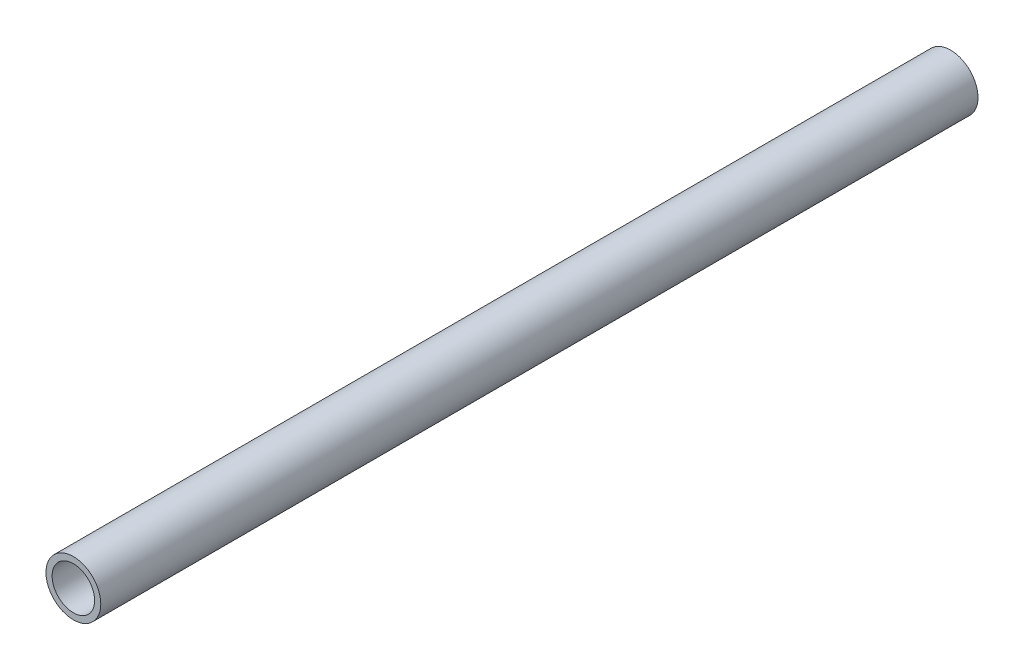
ISO-10303-21;
HEADER;
FILE_DESCRIPTION(('STEP AP214'),'2;1');
FILE_NAME('part.step','',(''),(''),'','','');
FILE_SCHEMA(('AUTOMOTIVE_DESIGN { 1 0 10303 214 1 1 1 1 }'));
ENDSEC;
DATA;
#1=APPLICATION_CONTEXT('core data for automotive mechanical design processes');
#2=APPLICATION_PROTOCOL_DEFINITION('international standard','automotive_design',2000,#1);
#3=PRODUCT_CONTEXT('',#1,'mechanical');
#4=PRODUCT('Part','Part','',(#3));
#5=PRODUCT_RELATED_PRODUCT_CATEGORY('part','',(#4));
#6=PRODUCT_DEFINITION_FORMATION('','',#4);
#7=PRODUCT_DEFINITION_CONTEXT('part definition',#1,'design');
#8=PRODUCT_DEFINITION('design','',#6,#7);
#9=PRODUCT_DEFINITION_SHAPE('','',#8);
#10=(LENGTH_UNIT() NAMED_UNIT(*) SI_UNIT(.MILLI.,.METRE.));
#11=(NAMED_UNIT(*) PLANE_ANGLE_UNIT() SI_UNIT($,.RADIAN.));
#12=(NAMED_UNIT(*) SI_UNIT($,.STERADIAN.) SOLID_ANGLE_UNIT());
#13=UNCERTAINTY_MEASURE_WITH_UNIT(LENGTH_MEASURE(1.E-05),#10,'distance_accuracy_value','');
#14=(GEOMETRIC_REPRESENTATION_CONTEXT(3) GLOBAL_UNCERTAINTY_ASSIGNED_CONTEXT((#13)) GLOBAL_UNIT_ASSIGNED_CONTEXT((#10,
#11,#12)) REPRESENTATION_CONTEXT('',''));
#15=CARTESIAN_POINT('',(0.,0.,0.));
#16=DIRECTION('',(0.,0.,1.));
#17=DIRECTION('',(1.,0.,0.));
#18=AXIS2_PLACEMENT_3D('',#15,#16,#17);
#19=CARTESIAN_POINT('',(0.,0.,200.));
#20=DIRECTION('',(0.,0.,1.));
#21=DIRECTION('',(1.,0.,0.));
#22=AXIS2_PLACEMENT_3D('',#19,#20,#21);
#23=PLANE('',#22);
#24=CARTESIAN_POINT('',(0.,0.,200.));
#25=DIRECTION('',(0.,0.,1.));
#26=DIRECTION('',(1.,0.,0.));
#27=AXIS2_PLACEMENT_3D('',#24,#25,#26);
#28=CIRCLE('',#27,12.5);
#29=CARTESIAN_POINT('',(12.5,0.,200.));
#30=VERTEX_POINT('',#29);
#31=EDGE_CURVE('E10',#30,#30,#28,.T.);
#32=ORIENTED_EDGE('',*,*,#31,.T.);
#33=EDGE_LOOP('',(#32));
#34=FACE_BOUND('',#33,.T.);
#35=CARTESIAN_POINT('',(0.,0.,200.));
#36=DIRECTION('',(0.,0.,1.));
#37=DIRECTION('',(1.,0.,0.));
#38=AXIS2_PLACEMENT_3D('',#35,#36,#37);
#39=CIRCLE('',#38,9.7);
#40=CARTESIAN_POINT('',(9.7,0.,200.));
#41=VERTEX_POINT('',#40);
#42=EDGE_CURVE('E44',#41,#41,#39,.T.);
#43=ORIENTED_EDGE('',*,*,#42,.F.);
#44=EDGE_LOOP('',(#43));
#45=FACE_BOUND('',#44,.T.);
#46=ADVANCED_FACE('F33',(#34,#45),#23,.T.);
#47=CARTESIAN_POINT('',(0.,0.,-200.));
#48=DIRECTION('',(0.,0.,1.));
#49=DIRECTION('',(1.,0.,0.));
#50=AXIS2_PLACEMENT_3D('',#47,#48,#49);
#51=PLANE('',#50);
#52=CARTESIAN_POINT('',(0.,0.,-200.));
#53=DIRECTION('',(0.,0.,1.));
#54=DIRECTION('',(1.,0.,0.));
#55=AXIS2_PLACEMENT_3D('',#52,#53,#54);
#56=CIRCLE('',#55,12.5);
#57=CARTESIAN_POINT('',(12.5,0.,-200.));
#58=VERTEX_POINT('',#57);
#59=EDGE_CURVE('E37',#58,#58,#56,.T.);
#60=ORIENTED_EDGE('',*,*,#59,.F.);
#61=EDGE_LOOP('',(#60));
#62=FACE_BOUND('',#61,.T.);
#63=CARTESIAN_POINT('',(0.,0.,-200.));
#64=DIRECTION('',(0.,0.,1.));
#65=DIRECTION('',(1.,0.,0.));
#66=AXIS2_PLACEMENT_3D('',#63,#64,#65);
#67=CIRCLE('',#66,9.7);
#68=CARTESIAN_POINT('',(9.7,0.,-200.));
#69=VERTEX_POINT('',#68);
#70=EDGE_CURVE('E46',#69,#69,#67,.T.);
#71=ORIENTED_EDGE('',*,*,#70,.T.);
#72=EDGE_LOOP('',(#71));
#73=FACE_BOUND('',#72,.T.);
#74=ADVANCED_FACE('F56',(#62,#73),#51,.F.);
#75=CARTESIAN_POINT('',(0.,0.,200.));
#76=DIRECTION('',(0.,0.,-1.));
#77=DIRECTION('',(-1.,0.,0.));
#78=AXIS2_PLACEMENT_3D('',#75,#76,#77);
#79=CYLINDRICAL_SURFACE('',#78,12.5);
#80=ORIENTED_EDGE('',*,*,#31,.F.);
#81=EDGE_LOOP('',(#80));
#82=FACE_BOUND('',#81,.T.);
#83=ORIENTED_EDGE('',*,*,#59,.T.);
#84=EDGE_LOOP('',(#83));
#85=FACE_BOUND('',#84,.T.);
#86=ADVANCED_FACE('F35',(#82,#85),#79,.T.);
#87=CARTESIAN_POINT('',(0.,0.,200.));
#88=DIRECTION('',(0.,0.,-1.));
#89=DIRECTION('',(-1.,0.,0.));
#90=AXIS2_PLACEMENT_3D('',#87,#88,#89);
#91=CYLINDRICAL_SURFACE('',#90,9.7);
#92=ORIENTED_EDGE('',*,*,#42,.T.);
#93=EDGE_LOOP('',(#92));
#94=FACE_BOUND('',#93,.T.);
#95=ORIENTED_EDGE('',*,*,#70,.F.);
#96=EDGE_LOOP('',(#95));
#97=FACE_BOUND('',#96,.T.);
#98=ADVANCED_FACE('F52',(#94,#97),#91,.F.);
#99=CLOSED_SHELL('',(#46,#74,#86,#98));
#100=MANIFOLD_SOLID_BREP('B2',#99);
#101=ADVANCED_BREP_SHAPE_REPRESENTATION('',(#18,#100),#14);
#102=SHAPE_DEFINITION_REPRESENTATION(#9,#101);
ENDSEC;
END-ISO-10303-21;
